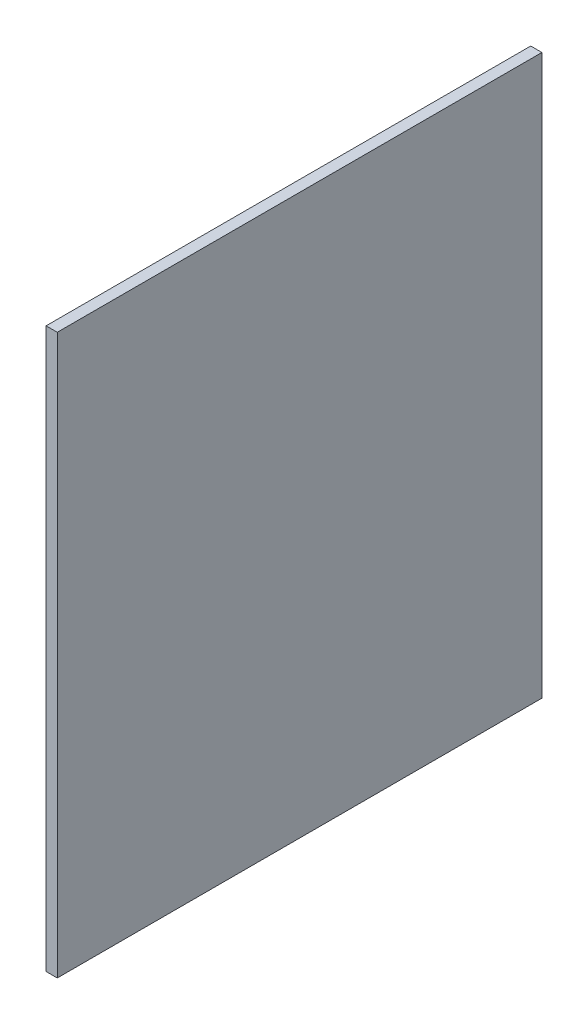
ISO-10303-21;
HEADER;
FILE_DESCRIPTION(('STEP AP214'),'2;1');
FILE_NAME('part.step','',(''),(''),'','','');
FILE_SCHEMA(('AUTOMOTIVE_DESIGN { 1 0 10303 214 1 1 1 1 }'));
ENDSEC;
DATA;
#1=APPLICATION_CONTEXT('core data for automotive mechanical design processes');
#2=APPLICATION_PROTOCOL_DEFINITION('international standard','automotive_design',2000,#1);
#3=PRODUCT_CONTEXT('',#1,'mechanical');
#4=PRODUCT('Part','Part','',(#3));
#5=PRODUCT_RELATED_PRODUCT_CATEGORY('part','',(#4));
#6=PRODUCT_DEFINITION_FORMATION('','',#4);
#7=PRODUCT_DEFINITION_CONTEXT('part definition',#1,'design');
#8=PRODUCT_DEFINITION('design','',#6,#7);
#9=PRODUCT_DEFINITION_SHAPE('','',#8);
#10=(LENGTH_UNIT() NAMED_UNIT(*) SI_UNIT(.MILLI.,.METRE.));
#11=(NAMED_UNIT(*) PLANE_ANGLE_UNIT() SI_UNIT($,.RADIAN.));
#12=(NAMED_UNIT(*) SI_UNIT($,.STERADIAN.) SOLID_ANGLE_UNIT());
#13=UNCERTAINTY_MEASURE_WITH_UNIT(LENGTH_MEASURE(1.E-05),#10,'distance_accuracy_value','');
#14=(GEOMETRIC_REPRESENTATION_CONTEXT(3) GLOBAL_UNCERTAINTY_ASSIGNED_CONTEXT((#13)) GLOBAL_UNIT_ASSIGNED_CONTEXT((#10,
#11,#12)) REPRESENTATION_CONTEXT('',''));
#15=CARTESIAN_POINT('',(0.,0.,0.));
#16=DIRECTION('',(0.,0.,1.));
#17=DIRECTION('',(1.,0.,0.));
#18=AXIS2_PLACEMENT_3D('',#15,#16,#17);
#19=CARTESIAN_POINT('',(3.,0.,0.));
#20=DIRECTION('',(0.,0.,-1.));
#21=DIRECTION('',(-1.,0.,0.));
#22=AXIS2_PLACEMENT_3D('',#19,#20,#21);
#23=PLANE('',#22);
#24=DIRECTION('',(0.,-1.,0.));
#25=VECTOR('',#24,1.);
#26=CARTESIAN_POINT('',(0.,0.,0.));
#27=LINE('',#26,#25);
#28=CARTESIAN_POINT('',(0.,150.,0.));
#29=VERTEX_POINT('',#28);
#30=CARTESIAN_POINT('',(0.,0.,0.));
#31=VERTEX_POINT('',#30);
#32=EDGE_CURVE('E96',#29,#31,#27,.T.);
#33=ORIENTED_EDGE('',*,*,#32,.T.);
#34=DIRECTION('',(-1.,0.,0.));
#35=VECTOR('',#34,1.);
#36=CARTESIAN_POINT('',(3.,0.,0.));
#37=LINE('',#36,#35);
#38=CARTESIAN_POINT('',(3.,0.,0.));
#39=VERTEX_POINT('',#38);
#40=EDGE_CURVE('E11',#39,#31,#37,.T.);
#41=ORIENTED_EDGE('',*,*,#40,.F.);
#42=DIRECTION('',(0.,-1.,0.));
#43=VECTOR('',#42,1.);
#44=CARTESIAN_POINT('',(3.,0.,0.));
#45=LINE('',#44,#43);
#46=CARTESIAN_POINT('',(3.,150.,0.));
#47=VERTEX_POINT('',#46);
#48=EDGE_CURVE('E84',#47,#39,#45,.T.);
#49=ORIENTED_EDGE('',*,*,#48,.F.);
#50=DIRECTION('',(-1.,0.,0.));
#51=VECTOR('',#50,1.);
#52=CARTESIAN_POINT('',(3.,150.,0.));
#53=LINE('',#52,#51);
#54=EDGE_CURVE('E92',#47,#29,#53,.T.);
#55=ORIENTED_EDGE('',*,*,#54,.T.);
#56=EDGE_LOOP('',(#33,#41,#49,#55));
#57=FACE_BOUND('',#56,.T.);
#58=ADVANCED_FACE('F33',(#57),#23,.F.);
#59=CARTESIAN_POINT('',(3.,0.,0.));
#60=DIRECTION('',(0.,1.,0.));
#61=DIRECTION('',(0.,0.,1.));
#62=AXIS2_PLACEMENT_3D('',#59,#60,#61);
#63=PLANE('',#62);
#64=DIRECTION('',(0.,0.,-1.));
#65=VECTOR('',#64,1.);
#66=CARTESIAN_POINT('',(0.,0.,0.));
#67=LINE('',#66,#65);
#68=CARTESIAN_POINT('',(0.,0.,-130.));
#69=VERTEX_POINT('',#68);
#70=EDGE_CURVE('E88',#31,#69,#67,.T.);
#71=ORIENTED_EDGE('',*,*,#70,.T.);
#72=DIRECTION('',(-1.,0.,0.));
#73=VECTOR('',#72,1.);
#74=CARTESIAN_POINT('',(3.,0.,-130.));
#75=LINE('',#74,#73);
#76=CARTESIAN_POINT('',(3.,0.,-130.));
#77=VERTEX_POINT('',#76);
#78=EDGE_CURVE('E41',#77,#69,#75,.T.);
#79=ORIENTED_EDGE('',*,*,#78,.F.);
#80=DIRECTION('',(0.,0.,-1.));
#81=VECTOR('',#80,1.);
#82=CARTESIAN_POINT('',(3.,0.,0.));
#83=LINE('',#82,#81);
#84=EDGE_CURVE('E79',#39,#77,#83,.T.);
#85=ORIENTED_EDGE('',*,*,#84,.F.);
#86=ORIENTED_EDGE('',*,*,#40,.T.);
#87=EDGE_LOOP('',(#71,#79,#85,#86));
#88=FACE_BOUND('',#87,.T.);
#89=ADVANCED_FACE('F87',(#88),#63,.F.);
#90=CARTESIAN_POINT('',(3.,0.,-130.));
#91=DIRECTION('',(0.,0.,1.));
#92=DIRECTION('',(1.,0.,0.));
#93=AXIS2_PLACEMENT_3D('',#90,#91,#92);
#94=PLANE('',#93);
#95=DIRECTION('',(0.,1.,0.));
#96=VECTOR('',#95,1.);
#97=CARTESIAN_POINT('',(0.,0.,-130.));
#98=LINE('',#97,#96);
#99=CARTESIAN_POINT('',(0.,150.,-130.));
#100=VERTEX_POINT('',#99);
#101=EDGE_CURVE('E66',#69,#100,#98,.T.);
#102=ORIENTED_EDGE('',*,*,#101,.T.);
#103=DIRECTION('',(-1.,0.,0.));
#104=VECTOR('',#103,1.);
#105=CARTESIAN_POINT('',(3.,150.,-130.));
#106=LINE('',#105,#104);
#107=CARTESIAN_POINT('',(3.,150.,-130.));
#108=VERTEX_POINT('',#107);
#109=EDGE_CURVE('E89',#108,#100,#106,.T.);
#110=ORIENTED_EDGE('',*,*,#109,.F.);
#111=DIRECTION('',(0.,1.,0.));
#112=VECTOR('',#111,1.);
#113=CARTESIAN_POINT('',(3.,0.,-130.));
#114=LINE('',#113,#112);
#115=EDGE_CURVE('E82',#77,#108,#114,.T.);
#116=ORIENTED_EDGE('',*,*,#115,.F.);
#117=ORIENTED_EDGE('',*,*,#78,.T.);
#118=EDGE_LOOP('',(#102,#110,#116,#117));
#119=FACE_BOUND('',#118,.T.);
#120=ADVANCED_FACE('F90',(#119),#94,.F.);
#121=CARTESIAN_POINT('',(3.,150.,0.));
#122=DIRECTION('',(0.,-1.,0.));
#123=DIRECTION('',(0.,0.,-1.));
#124=AXIS2_PLACEMENT_3D('',#121,#122,#123);
#125=PLANE('',#124);
#126=DIRECTION('',(0.,0.,1.));
#127=VECTOR('',#126,1.);
#128=CARTESIAN_POINT('',(0.,150.,0.));
#129=LINE('',#128,#127);
#130=EDGE_CURVE('E72',#100,#29,#129,.T.);
#131=ORIENTED_EDGE('',*,*,#130,.T.);
#132=ORIENTED_EDGE('',*,*,#54,.F.);
#133=DIRECTION('',(0.,0.,1.));
#134=VECTOR('',#133,1.);
#135=CARTESIAN_POINT('',(3.,150.,0.));
#136=LINE('',#135,#134);
#137=EDGE_CURVE('E49',#108,#47,#136,.T.);
#138=ORIENTED_EDGE('',*,*,#137,.F.);
#139=ORIENTED_EDGE('',*,*,#109,.T.);
#140=EDGE_LOOP('',(#131,#132,#138,#139));
#141=FACE_BOUND('',#140,.T.);
#142=ADVANCED_FACE('F103',(#141),#125,.F.);
#143=CARTESIAN_POINT('',(3.,0.,0.));
#144=DIRECTION('',(-1.,0.,0.));
#145=DIRECTION('',(0.,0.,1.));
#146=AXIS2_PLACEMENT_3D('',#143,#144,#145);
#147=PLANE('',#146);
#148=ORIENTED_EDGE('',*,*,#48,.T.);
#149=ORIENTED_EDGE('',*,*,#84,.T.);
#150=ORIENTED_EDGE('',*,*,#115,.T.);
#151=ORIENTED_EDGE('',*,*,#137,.T.);
#152=EDGE_LOOP('',(#148,#149,#150,#151));
#153=FACE_BOUND('',#152,.T.);
#154=ADVANCED_FACE('F80',(#153),#147,.F.);
#155=CARTESIAN_POINT('',(0.,0.,0.));
#156=DIRECTION('',(-1.,0.,0.));
#157=DIRECTION('',(0.,0.,1.));
#158=AXIS2_PLACEMENT_3D('',#155,#156,#157);
#159=PLANE('',#158);
#160=ORIENTED_EDGE('',*,*,#32,.F.);
#161=ORIENTED_EDGE('',*,*,#130,.F.);
#162=ORIENTED_EDGE('',*,*,#101,.F.);
#163=ORIENTED_EDGE('',*,*,#70,.F.);
#164=EDGE_LOOP('',(#160,#161,#162,#163));
#165=FACE_BOUND('',#164,.T.);
#166=ADVANCED_FACE('F106',(#165),#159,.T.);
#167=CLOSED_SHELL('',(#58,#89,#120,#142,#154,#166));
#168=MANIFOLD_SOLID_BREP('B2',#167);
#169=ADVANCED_BREP_SHAPE_REPRESENTATION('',(#18,#168),#14);
#170=SHAPE_DEFINITION_REPRESENTATION(#9,#169);
ENDSEC;
END-ISO-10303-21;
